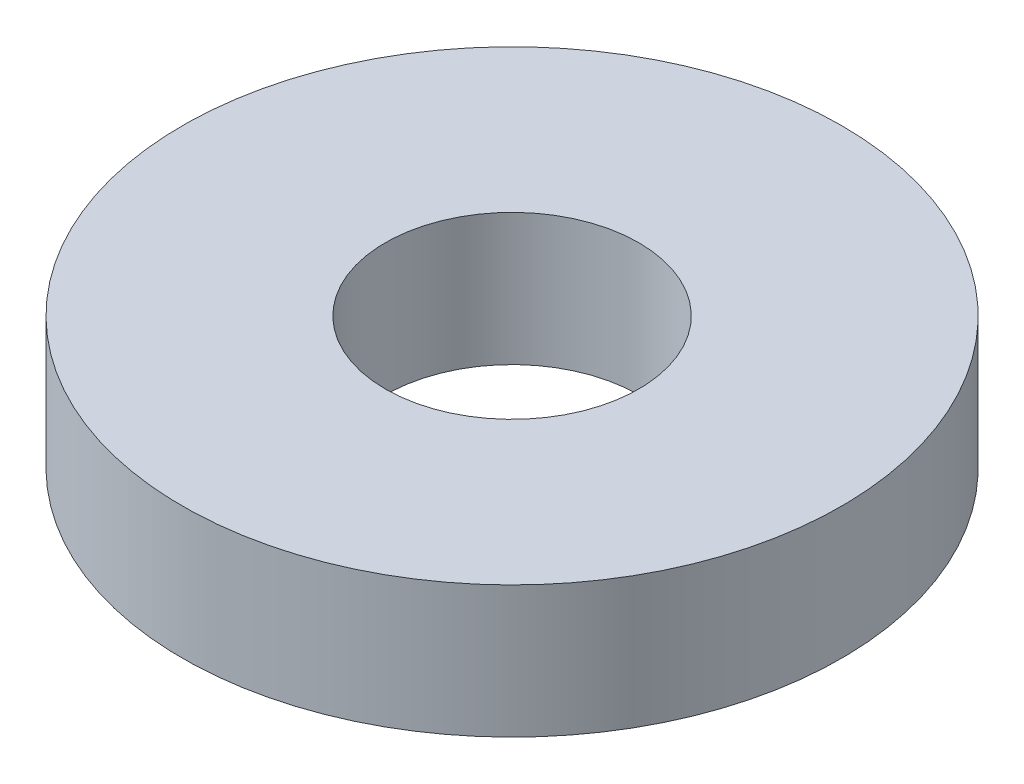
ISO-10303-21;
HEADER;
FILE_DESCRIPTION(('STEP AP214'),'2;1');
FILE_NAME('part.step','',(''),(''),'','','');
FILE_SCHEMA(('AUTOMOTIVE_DESIGN { 1 0 10303 214 1 1 1 1 }'));
ENDSEC;
DATA;
#1=APPLICATION_CONTEXT('core data for automotive mechanical design processes');
#2=APPLICATION_PROTOCOL_DEFINITION('international standard','automotive_design',2000,#1);
#3=PRODUCT_CONTEXT('',#1,'mechanical');
#4=PRODUCT('Part','Part','',(#3));
#5=PRODUCT_RELATED_PRODUCT_CATEGORY('part','',(#4));
#6=PRODUCT_DEFINITION_FORMATION('','',#4);
#7=PRODUCT_DEFINITION_CONTEXT('part definition',#1,'design');
#8=PRODUCT_DEFINITION('design','',#6,#7);
#9=PRODUCT_DEFINITION_SHAPE('','',#8);
#10=(LENGTH_UNIT() NAMED_UNIT(*) SI_UNIT(.MILLI.,.METRE.));
#11=(NAMED_UNIT(*) PLANE_ANGLE_UNIT() SI_UNIT($,.RADIAN.));
#12=(NAMED_UNIT(*) SI_UNIT($,.STERADIAN.) SOLID_ANGLE_UNIT());
#13=UNCERTAINTY_MEASURE_WITH_UNIT(LENGTH_MEASURE(1.E-05),#10,'distance_accuracy_value','');
#14=(GEOMETRIC_REPRESENTATION_CONTEXT(3) GLOBAL_UNCERTAINTY_ASSIGNED_CONTEXT((#13)) GLOBAL_UNIT_ASSIGNED_CONTEXT((#10,
#11,#12)) REPRESENTATION_CONTEXT('',''));
#15=CARTESIAN_POINT('',(0.,0.,0.));
#16=DIRECTION('',(0.,0.,1.));
#17=DIRECTION('',(1.,0.,0.));
#18=AXIS2_PLACEMENT_3D('',#15,#16,#17);
#19=CARTESIAN_POINT('',(0.,26.,0.));
#20=DIRECTION('',(0.,-1.,0.));
#21=DIRECTION('',(0.,0.,-1.));
#22=AXIS2_PLACEMENT_3D('',#19,#20,#21);
#23=CYLINDRICAL_SURFACE('',#22,65.);
#24=CARTESIAN_POINT('',(0.,26.,0.));
#25=DIRECTION('',(0.,1.,0.));
#26=DIRECTION('',(0.,0.,1.));
#27=AXIS2_PLACEMENT_3D('',#24,#25,#26);
#28=CIRCLE('',#27,65.);
#29=CARTESIAN_POINT('',(0.,26.,-65.));
#30=VERTEX_POINT('',#29);
#31=EDGE_CURVE('E10',#30,#30,#28,.T.);
#32=CARTESIAN_POINT('',(0.,0.,0.));
#33=DIRECTION('',(0.,1.,0.));
#34=DIRECTION('',(0.,0.,1.));
#35=AXIS2_PLACEMENT_3D('',#32,#33,#34);
#36=CIRCLE('',#35,65.);
#37=CARTESIAN_POINT('',(0.,0.,-65.));
#38=VERTEX_POINT('',#37);
#39=EDGE_CURVE('E37',#38,#38,#36,.T.);
#40=CARTESIAN_POINT('',(0.,26.,-65.));
#41=CARTESIAN_POINT('',(0.,25.7291666666667,-65.));
#42=CARTESIAN_POINT('',(0.,25.4583333333333,-65.));
#43=CARTESIAN_POINT('',(0.,24.9166666666667,-65.));
#44=CARTESIAN_POINT('',(0.,24.6458333333333,-65.));
#45=CARTESIAN_POINT('',(0.,24.1041666666667,-65.));
#46=CARTESIAN_POINT('',(0.,23.8333333333333,-65.));
#47=CARTESIAN_POINT('',(0.,23.2916666666667,-65.));
#48=CARTESIAN_POINT('',(0.,23.0208333333333,-65.));
#49=CARTESIAN_POINT('',(0.,22.4791666666667,-65.));
#50=CARTESIAN_POINT('',(0.,22.2083333333333,-65.));
#51=CARTESIAN_POINT('',(0.,21.6666666666667,-65.));
#52=CARTESIAN_POINT('',(0.,21.3958333333333,-65.));
#53=CARTESIAN_POINT('',(0.,20.8541666666667,-65.));
#54=CARTESIAN_POINT('',(0.,20.5833333333333,-65.));
#55=CARTESIAN_POINT('',(0.,20.0416666666667,-65.));
#56=CARTESIAN_POINT('',(0.,19.7708333333333,-65.));
#57=CARTESIAN_POINT('',(0.,19.2291666666667,-65.));
#58=CARTESIAN_POINT('',(0.,18.9583333333333,-65.));
#59=CARTESIAN_POINT('',(0.,18.4166666666667,-65.));
#60=CARTESIAN_POINT('',(0.,18.1458333333333,-65.));
#61=CARTESIAN_POINT('',(0.,17.6041666666667,-65.));
#62=CARTESIAN_POINT('',(0.,17.3333333333333,-65.));
#63=CARTESIAN_POINT('',(0.,16.7916666666667,-65.));
#64=CARTESIAN_POINT('',(0.,16.5208333333333,-65.));
#65=CARTESIAN_POINT('',(0.,15.9791666666667,-65.));
#66=CARTESIAN_POINT('',(0.,15.7083333333333,-65.));
#67=CARTESIAN_POINT('',(0.,15.1666666666667,-65.));
#68=CARTESIAN_POINT('',(0.,14.8958333333333,-65.));
#69=CARTESIAN_POINT('',(0.,14.3541666666667,-65.));
#70=CARTESIAN_POINT('',(0.,14.0833333333333,-65.));
#71=CARTESIAN_POINT('',(0.,13.5416666666667,-65.));
#72=CARTESIAN_POINT('',(0.,13.2708333333333,-65.));
#73=CARTESIAN_POINT('',(0.,12.7291666666667,-65.));
#74=CARTESIAN_POINT('',(0.,12.4583333333333,-65.));
#75=CARTESIAN_POINT('',(0.,11.9166666666667,-65.));
#76=CARTESIAN_POINT('',(0.,11.6458333333333,-65.));
#77=CARTESIAN_POINT('',(0.,11.1041666666667,-65.));
#78=CARTESIAN_POINT('',(0.,10.8333333333333,-65.));
#79=CARTESIAN_POINT('',(0.,10.2916666666667,-65.));
#80=CARTESIAN_POINT('',(0.,10.0208333333333,-65.));
#81=CARTESIAN_POINT('',(0.,9.47916666666667,-65.));
#82=CARTESIAN_POINT('',(0.,9.20833333333333,-65.));
#83=CARTESIAN_POINT('',(0.,8.66666666666667,-65.));
#84=CARTESIAN_POINT('',(0.,8.39583333333333,-65.));
#85=CARTESIAN_POINT('',(0.,7.85416666666667,-65.));
#86=CARTESIAN_POINT('',(0.,7.58333333333333,-65.));
#87=CARTESIAN_POINT('',(0.,7.04166666666667,-65.));
#88=CARTESIAN_POINT('',(0.,6.77083333333333,-65.));
#89=CARTESIAN_POINT('',(0.,6.22916666666667,-65.));
#90=CARTESIAN_POINT('',(0.,5.95833333333333,-65.));
#91=CARTESIAN_POINT('',(0.,5.41666666666667,-65.));
#92=CARTESIAN_POINT('',(0.,5.14583333333333,-65.));
#93=CARTESIAN_POINT('',(0.,4.60416666666667,-65.));
#94=CARTESIAN_POINT('',(0.,4.33333333333333,-65.));
#95=CARTESIAN_POINT('',(0.,3.79166666666667,-65.));
#96=CARTESIAN_POINT('',(0.,3.52083333333333,-65.));
#97=CARTESIAN_POINT('',(0.,2.97916666666667,-65.));
#98=CARTESIAN_POINT('',(0.,2.70833333333333,-65.));
#99=CARTESIAN_POINT('',(0.,2.16666666666667,-65.));
#100=CARTESIAN_POINT('',(0.,1.89583333333333,-65.));
#101=CARTESIAN_POINT('',(0.,1.35416666666667,-65.));
#102=CARTESIAN_POINT('',(0.,1.08333333333333,-65.));
#103=CARTESIAN_POINT('',(0.,0.541666666666667,-65.));
#104=CARTESIAN_POINT('',(0.,0.270833333333334,-65.));
#105=CARTESIAN_POINT('',(0.,0.,-65.));
#106=B_SPLINE_CURVE_WITH_KNOTS('',3,(#40,#41,#42,#43,#44,#45,#46,#47,#48,#49,#50,#51,#52,#53,
#54,#55,#56,#57,#58,#59,#60,#61,#62,#63,#64,#65,#66,#67,#68,#69,#70,#71,#72,#73,#74,#75,#76,#77,
#78,#79,#80,#81,#82,#83,#84,#85,#86,#87,#88,#89,#90,#91,#92,#93,#94,#95,#96,#97,#98,#99,#100,
#101,#102,#103,#104,#105),.UNSPECIFIED.,.F.,.F.,(4,2,2,2,2,2,2,2,2,2,2,2,2,2,2,2,2,2,2,2,2,2,2,
2,2,2,2,2,2,2,2,2,4),(0.,0.812499999999997,1.625,2.4375,3.25,4.0625,4.875,5.6875,6.5,7.3125,
8.125,8.93749999999999,9.74999999999999,10.5625,11.375,12.1875,13.,13.8125,14.625,15.4375,16.25,
17.0625,17.875,18.6875,19.5,20.3125,21.125,21.9375,22.75,23.5625,24.375,25.1875,26.),.UNSPECIFIED.);
#107=EDGE_CURVE('BSEAM40',#30,#38,#106,.T.);
#108=ORIENTED_EDGE('',*,*,#31,.F.);
#109=ORIENTED_EDGE('',*,*,#39,.T.);
#110=ORIENTED_EDGE('',*,*,#107,.T.);
#111=ORIENTED_EDGE('',*,*,#107,.F.);
#112=EDGE_LOOP('',(#108,#110,#109,#111));
#113=FACE_BOUND('',#112,.T.);
#114=ADVANCED_FACE('F40',(#113),#23,.T.);
#115=CARTESIAN_POINT('',(0.,26.,0.));
#116=DIRECTION('',(0.,1.,0.));
#117=DIRECTION('',(0.,0.,1.));
#118=AXIS2_PLACEMENT_3D('',#115,#116,#117);
#119=PLANE('',#118);
#120=CARTESIAN_POINT('',(0.,26.,0.));
#121=DIRECTION('',(0.,1.,0.));
#122=DIRECTION('',(0.,0.,1.));
#123=AXIS2_PLACEMENT_3D('',#120,#121,#122);
#124=CIRCLE('',#123,25.);
#125=CARTESIAN_POINT('',(0.,26.,-25.));
#126=VERTEX_POINT('',#125);
#127=EDGE_CURVE('E50',#126,#126,#124,.T.);
#128=ORIENTED_EDGE('',*,*,#127,.F.);
#129=EDGE_LOOP('',(#128));
#130=FACE_BOUND('',#129,.T.);
#131=ORIENTED_EDGE('',*,*,#31,.T.);
#132=EDGE_LOOP('',(#131));
#133=FACE_BOUND('',#132,.T.);
#134=ADVANCED_FACE('F59',(#130,#133),#119,.T.);
#135=CARTESIAN_POINT('',(0.,0.,0.));
#136=DIRECTION('',(0.,1.,0.));
#137=DIRECTION('',(0.,0.,1.));
#138=AXIS2_PLACEMENT_3D('',#135,#136,#137);
#139=PLANE('',#138);
#140=CARTESIAN_POINT('',(0.,0.,0.));
#141=DIRECTION('',(0.,1.,0.));
#142=DIRECTION('',(0.,0.,1.));
#143=AXIS2_PLACEMENT_3D('',#140,#141,#142);
#144=CIRCLE('',#143,25.);
#145=CARTESIAN_POINT('',(0.,0.,-25.));
#146=VERTEX_POINT('',#145);
#147=EDGE_CURVE('E47',#146,#146,#144,.T.);
#148=ORIENTED_EDGE('',*,*,#147,.T.);
#149=EDGE_LOOP('',(#148));
#150=FACE_BOUND('',#149,.T.);
#151=ORIENTED_EDGE('',*,*,#39,.F.);
#152=EDGE_LOOP('',(#151));
#153=FACE_BOUND('',#152,.T.);
#154=ADVANCED_FACE('F58',(#150,#153),#139,.F.);
#155=CARTESIAN_POINT('',(0.,26.,0.));
#156=DIRECTION('',(0.,-1.,0.));
#157=DIRECTION('',(0.,0.,-1.));
#158=AXIS2_PLACEMENT_3D('',#155,#156,#157);
#159=CYLINDRICAL_SURFACE('',#158,25.);
#160=CARTESIAN_POINT('',(0.,26.,-25.));
#161=CARTESIAN_POINT('',(0.,25.7291666666667,-25.));
#162=CARTESIAN_POINT('',(0.,25.4583333333333,-25.));
#163=CARTESIAN_POINT('',(0.,24.9166666666667,-25.));
#164=CARTESIAN_POINT('',(0.,24.6458333333333,-25.));
#165=CARTESIAN_POINT('',(0.,24.1041666666667,-25.));
#166=CARTESIAN_POINT('',(0.,23.8333333333333,-25.));
#167=CARTESIAN_POINT('',(0.,23.2916666666667,-25.));
#168=CARTESIAN_POINT('',(0.,23.0208333333333,-25.));
#169=CARTESIAN_POINT('',(0.,22.4791666666667,-25.));
#170=CARTESIAN_POINT('',(0.,22.2083333333333,-25.));
#171=CARTESIAN_POINT('',(0.,21.6666666666667,-25.));
#172=CARTESIAN_POINT('',(0.,21.3958333333333,-25.));
#173=CARTESIAN_POINT('',(0.,20.8541666666667,-25.));
#174=CARTESIAN_POINT('',(0.,20.5833333333333,-25.));
#175=CARTESIAN_POINT('',(0.,20.0416666666667,-25.));
#176=CARTESIAN_POINT('',(0.,19.7708333333333,-25.));
#177=CARTESIAN_POINT('',(0.,19.2291666666667,-25.));
#178=CARTESIAN_POINT('',(0.,18.9583333333333,-25.));
#179=CARTESIAN_POINT('',(0.,18.4166666666667,-25.));
#180=CARTESIAN_POINT('',(0.,18.1458333333333,-25.));
#181=CARTESIAN_POINT('',(0.,17.6041666666667,-25.));
#182=CARTESIAN_POINT('',(0.,17.3333333333333,-25.));
#183=CARTESIAN_POINT('',(0.,16.7916666666667,-25.));
#184=CARTESIAN_POINT('',(0.,16.5208333333333,-25.));
#185=CARTESIAN_POINT('',(0.,15.9791666666667,-25.));
#186=CARTESIAN_POINT('',(0.,15.7083333333333,-25.));
#187=CARTESIAN_POINT('',(0.,15.1666666666667,-25.));
#188=CARTESIAN_POINT('',(0.,14.8958333333333,-25.));
#189=CARTESIAN_POINT('',(0.,14.3541666666667,-25.));
#190=CARTESIAN_POINT('',(0.,14.0833333333333,-25.));
#191=CARTESIAN_POINT('',(0.,13.5416666666667,-25.));
#192=CARTESIAN_POINT('',(0.,13.2708333333333,-25.));
#193=CARTESIAN_POINT('',(0.,12.7291666666667,-25.));
#194=CARTESIAN_POINT('',(0.,12.4583333333333,-25.));
#195=CARTESIAN_POINT('',(0.,11.9166666666667,-25.));
#196=CARTESIAN_POINT('',(0.,11.6458333333333,-25.));
#197=CARTESIAN_POINT('',(0.,11.1041666666667,-25.));
#198=CARTESIAN_POINT('',(0.,10.8333333333333,-25.));
#199=CARTESIAN_POINT('',(0.,10.2916666666667,-25.));
#200=CARTESIAN_POINT('',(0.,10.0208333333333,-25.));
#201=CARTESIAN_POINT('',(0.,9.47916666666667,-25.));
#202=CARTESIAN_POINT('',(0.,9.20833333333333,-25.));
#203=CARTESIAN_POINT('',(0.,8.66666666666667,-25.));
#204=CARTESIAN_POINT('',(0.,8.39583333333333,-25.));
#205=CARTESIAN_POINT('',(0.,7.85416666666667,-25.));
#206=CARTESIAN_POINT('',(0.,7.58333333333333,-25.));
#207=CARTESIAN_POINT('',(0.,7.04166666666667,-25.));
#208=CARTESIAN_POINT('',(0.,6.77083333333333,-25.));
#209=CARTESIAN_POINT('',(0.,6.22916666666667,-25.));
#210=CARTESIAN_POINT('',(0.,5.95833333333333,-25.));
#211=CARTESIAN_POINT('',(0.,5.41666666666667,-25.));
#212=CARTESIAN_POINT('',(0.,5.14583333333333,-25.));
#213=CARTESIAN_POINT('',(0.,4.60416666666667,-25.));
#214=CARTESIAN_POINT('',(0.,4.33333333333333,-25.));
#215=CARTESIAN_POINT('',(0.,3.79166666666667,-25.));
#216=CARTESIAN_POINT('',(0.,3.52083333333333,-25.));
#217=CARTESIAN_POINT('',(0.,2.97916666666667,-25.));
#218=CARTESIAN_POINT('',(0.,2.70833333333333,-25.));
#219=CARTESIAN_POINT('',(0.,2.16666666666667,-25.));
#220=CARTESIAN_POINT('',(0.,1.89583333333333,-25.));
#221=CARTESIAN_POINT('',(0.,1.35416666666667,-25.));
#222=CARTESIAN_POINT('',(0.,1.08333333333333,-25.));
#223=CARTESIAN_POINT('',(0.,0.541666666666667,-25.));
#224=CARTESIAN_POINT('',(0.,0.270833333333334,-25.));
#225=CARTESIAN_POINT('',(0.,0.,-25.));
#226=B_SPLINE_CURVE_WITH_KNOTS('',3,(#160,#161,#162,#163,#164,#165,#166,#167,#168,#169,#170,
#171,#172,#173,#174,#175,#176,#177,#178,#179,#180,#181,#182,#183,#184,#185,#186,#187,#188,#189,
#190,#191,#192,#193,#194,#195,#196,#197,#198,#199,#200,#201,#202,#203,#204,#205,#206,#207,#208,
#209,#210,#211,#212,#213,#214,#215,#216,#217,#218,#219,#220,#221,#222,#223,#224,#225),
.UNSPECIFIED.,.F.,.F.,(4,2,2,2,2,2,2,2,2,2,2,2,2,2,2,2,2,2,2,2,2,2,2,2,2,2,2,2,2,2,2,2,4),(0.,
0.812500000000001,1.625,2.4375,3.25,4.0625,4.875,5.6875,6.5,7.3125,8.125,8.9375,9.75,10.5625,
11.375,12.1875,13.,13.8125,14.625,15.4375,16.25,17.0625,17.875,18.6875,19.5,20.3125,21.125,
21.9375,22.75,23.5625,24.375,25.1875,26.),.UNSPECIFIED.);
#227=EDGE_CURVE('BSEAM54',#126,#146,#226,.T.);
#228=ORIENTED_EDGE('',*,*,#127,.T.);
#229=ORIENTED_EDGE('',*,*,#147,.F.);
#230=ORIENTED_EDGE('',*,*,#227,.T.);
#231=ORIENTED_EDGE('',*,*,#227,.F.);
#232=EDGE_LOOP('',(#228,#230,#229,#231));
#233=FACE_BOUND('',#232,.T.);
#234=ADVANCED_FACE('F54',(#233),#159,.F.);
#235=CLOSED_SHELL('',(#114,#134,#154,#234));
#236=MANIFOLD_SOLID_BREP('B2',#235);
#237=ADVANCED_BREP_SHAPE_REPRESENTATION('',(#18,#236),#14);
#238=SHAPE_DEFINITION_REPRESENTATION(#9,#237);
ENDSEC;
END-ISO-10303-21;
